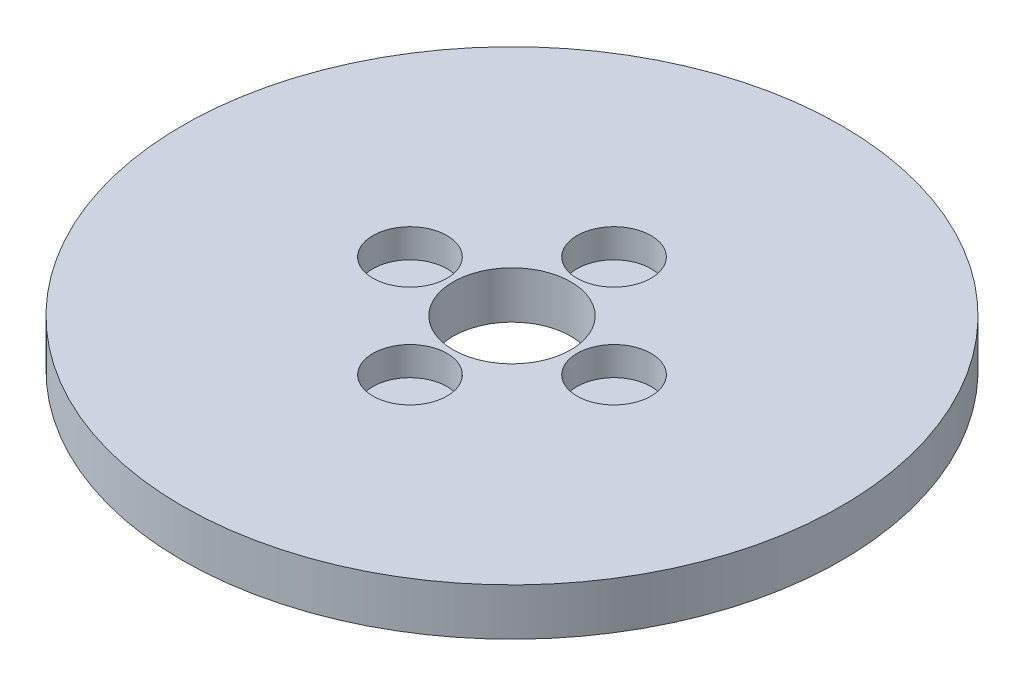
ISO-10303-21;
HEADER;
FILE_DESCRIPTION(('STEP AP214'),'2;1');
FILE_NAME('part.step','',(''),(''),'','','');
FILE_SCHEMA(('AUTOMOTIVE_DESIGN { 1 0 10303 214 1 1 1 1 }'));
ENDSEC;
DATA;
#1=APPLICATION_CONTEXT('core data for automotive mechanical design processes');
#2=APPLICATION_PROTOCOL_DEFINITION('international standard','automotive_design',2000,#1);
#3=PRODUCT_CONTEXT('',#1,'mechanical');
#4=PRODUCT('Part','Part','',(#3));
#5=PRODUCT_RELATED_PRODUCT_CATEGORY('part','',(#4));
#6=PRODUCT_DEFINITION_FORMATION('','',#4);
#7=PRODUCT_DEFINITION_CONTEXT('part definition',#1,'design');
#8=PRODUCT_DEFINITION('design','',#6,#7);
#9=PRODUCT_DEFINITION_SHAPE('','',#8);
#10=(LENGTH_UNIT() NAMED_UNIT(*) SI_UNIT(.MILLI.,.METRE.));
#11=(NAMED_UNIT(*) PLANE_ANGLE_UNIT() SI_UNIT($,.RADIAN.));
#12=(NAMED_UNIT(*) SI_UNIT($,.STERADIAN.) SOLID_ANGLE_UNIT());
#13=UNCERTAINTY_MEASURE_WITH_UNIT(LENGTH_MEASURE(1.E-05),#10,'distance_accuracy_value','');
#14=(GEOMETRIC_REPRESENTATION_CONTEXT(3) GLOBAL_UNCERTAINTY_ASSIGNED_CONTEXT((#13)) GLOBAL_UNIT_ASSIGNED_CONTEXT((#10,
#11,#12)) REPRESENTATION_CONTEXT('',''));
#15=CARTESIAN_POINT('',(0.,0.,0.));
#16=DIRECTION('',(0.,0.,1.));
#17=DIRECTION('',(1.,0.,0.));
#18=AXIS2_PLACEMENT_3D('',#15,#16,#17);
#19=CARTESIAN_POINT('',(0.,10.,0.));
#20=DIRECTION('',(0.,-1.,0.));
#21=DIRECTION('',(0.,0.,-1.));
#22=AXIS2_PLACEMENT_3D('',#19,#20,#21);
#23=CYLINDRICAL_SURFACE('',#22,70.);
#24=CARTESIAN_POINT('',(0.,10.,0.));
#25=DIRECTION('',(0.,1.,0.));
#26=DIRECTION('',(0.,0.,1.));
#27=AXIS2_PLACEMENT_3D('',#24,#25,#26);
#28=CIRCLE('',#27,70.);
#29=CARTESIAN_POINT('',(0.,10.,70.));
#30=VERTEX_POINT('',#29);
#31=EDGE_CURVE('E10',#30,#30,#28,.T.);
#32=ORIENTED_EDGE('',*,*,#31,.F.);
#33=EDGE_LOOP('',(#32));
#34=FACE_BOUND('',#33,.T.);
#35=CARTESIAN_POINT('',(0.,0.,0.));
#36=DIRECTION('',(0.,1.,0.));
#37=DIRECTION('',(0.,0.,1.));
#38=AXIS2_PLACEMENT_3D('',#35,#36,#37);
#39=CIRCLE('',#38,70.);
#40=CARTESIAN_POINT('',(0.,0.,70.));
#41=VERTEX_POINT('',#40);
#42=EDGE_CURVE('E37',#41,#41,#39,.T.);
#43=ORIENTED_EDGE('',*,*,#42,.T.);
#44=EDGE_LOOP('',(#43));
#45=FACE_BOUND('',#44,.T.);
#46=ADVANCED_FACE('F40',(#34,#45),#23,.T.);
#47=CARTESIAN_POINT('',(0.,10.,0.));
#48=DIRECTION('',(0.,1.,0.));
#49=DIRECTION('',(0.,0.,1.));
#50=AXIS2_PLACEMENT_3D('',#47,#48,#49);
#51=PLANE('',#50);
#52=CARTESIAN_POINT('',(0.,10.,21.6730612418728));
#53=DIRECTION('',(0.,1.,0.));
#54=DIRECTION('',(1.,0.,0.));
#55=AXIS2_PLACEMENT_3D('',#52,#53,#54);
#56=CIRCLE('',#55,7.86600903500661);
#57=CARTESIAN_POINT('',(7.86600903500669,10.,21.6730612418727));
#58=VERTEX_POINT('',#57);
#59=EDGE_CURVE('E71',#58,#58,#56,.T.);
#60=ORIENTED_EDGE('',*,*,#59,.F.);
#61=EDGE_LOOP('',(#60));
#62=FACE_BOUND('',#61,.T.);
#63=CARTESIAN_POINT('',(21.6730612418728,10.,0.));
#64=DIRECTION('',(0.,1.,0.));
#65=DIRECTION('',(0.,0.,-1.));
#66=AXIS2_PLACEMENT_3D('',#63,#64,#65);
#67=CIRCLE('',#66,7.86600903500661);
#68=CARTESIAN_POINT('',(21.6730612418728,10.,-7.86600903500661));
#69=VERTEX_POINT('',#68);
#70=EDGE_CURVE('E70',#69,#69,#67,.T.);
#71=ORIENTED_EDGE('',*,*,#70,.F.);
#72=EDGE_LOOP('',(#71));
#73=FACE_BOUND('',#72,.T.);
#74=CARTESIAN_POINT('',(-2.27013266644809E-13,10.,-21.6730612418728));
#75=DIRECTION('',(0.,1.,0.));
#76=DIRECTION('',(-1.,0.,0.));
#77=AXIS2_PLACEMENT_3D('',#74,#75,#76);
#78=CIRCLE('',#77,7.86600903500661);
#79=CARTESIAN_POINT('',(-7.86600903500684,10.,-21.6730612418727));
#80=VERTEX_POINT('',#79);
#81=EDGE_CURVE('E61',#80,#80,#78,.T.);
#82=ORIENTED_EDGE('',*,*,#81,.F.);
#83=EDGE_LOOP('',(#82));
#84=FACE_BOUND('',#83,.T.);
#85=CARTESIAN_POINT('',(-21.6730612418728,10.,0.));
#86=DIRECTION('',(0.,1.,0.));
#87=DIRECTION('',(0.,0.,1.));
#88=AXIS2_PLACEMENT_3D('',#85,#86,#87);
#89=CIRCLE('',#88,7.86600903500661);
#90=CARTESIAN_POINT('',(-21.6730612418728,10.,7.86600903500661));
#91=VERTEX_POINT('',#90);
#92=EDGE_CURVE('E54',#91,#91,#89,.T.);
#93=ORIENTED_EDGE('',*,*,#92,.F.);
#94=EDGE_LOOP('',(#93));
#95=FACE_BOUND('',#94,.T.);
#96=CARTESIAN_POINT('',(0.,10.,0.));
#97=DIRECTION('',(0.,1.,0.));
#98=DIRECTION('',(0.,0.,1.));
#99=AXIS2_PLACEMENT_3D('',#96,#97,#98);
#100=CIRCLE('',#99,12.5);
#101=CARTESIAN_POINT('',(0.,10.,12.5));
#102=VERTEX_POINT('',#101);
#103=EDGE_CURVE('E50',#102,#102,#100,.T.);
#104=ORIENTED_EDGE('',*,*,#103,.F.);
#105=EDGE_LOOP('',(#104));
#106=FACE_BOUND('',#105,.T.);
#107=ORIENTED_EDGE('',*,*,#31,.T.);
#108=EDGE_LOOP('',(#107));
#109=FACE_BOUND('',#108,.T.);
#110=ADVANCED_FACE('F86',(#62,#73,#84,#95,#106,#109),#51,.T.);
#111=CARTESIAN_POINT('',(0.,0.,0.));
#112=DIRECTION('',(0.,1.,0.));
#113=DIRECTION('',(0.,0.,1.));
#114=AXIS2_PLACEMENT_3D('',#111,#112,#113);
#115=PLANE('',#114);
#116=CARTESIAN_POINT('',(0.,0.,0.));
#117=DIRECTION('',(0.,1.,0.));
#118=DIRECTION('',(0.,0.,1.));
#119=AXIS2_PLACEMENT_3D('',#116,#117,#118);
#120=CIRCLE('',#119,12.5);
#121=CARTESIAN_POINT('',(0.,0.,12.5));
#122=VERTEX_POINT('',#121);
#123=EDGE_CURVE('E47',#122,#122,#120,.T.);
#124=ORIENTED_EDGE('',*,*,#123,.T.);
#125=EDGE_LOOP('',(#124));
#126=FACE_BOUND('',#125,.T.);
#127=ORIENTED_EDGE('',*,*,#42,.F.);
#128=EDGE_LOOP('',(#127));
#129=FACE_BOUND('',#128,.T.);
#130=ADVANCED_FACE('F93',(#126,#129),#115,.F.);
#131=CARTESIAN_POINT('',(0.,10.,0.));
#132=DIRECTION('',(0.,-1.,0.));
#133=DIRECTION('',(0.,0.,-1.));
#134=AXIS2_PLACEMENT_3D('',#131,#132,#133);
#135=CYLINDRICAL_SURFACE('',#134,12.5);
#136=ORIENTED_EDGE('',*,*,#103,.T.);
#137=EDGE_LOOP('',(#136));
#138=FACE_BOUND('',#137,.T.);
#139=ORIENTED_EDGE('',*,*,#123,.F.);
#140=EDGE_LOOP('',(#139));
#141=FACE_BOUND('',#140,.T.);
#142=ADVANCED_FACE('F101',(#138,#141),#135,.F.);
#143=CARTESIAN_POINT('',(-21.6730612418728,3.89825433813243,0.));
#144=DIRECTION('',(0.,1.,0.));
#145=DIRECTION('',(0.,0.,1.));
#146=AXIS2_PLACEMENT_3D('',#143,#144,#145);
#147=CYLINDRICAL_SURFACE('',#146,7.86600903500661);
#148=CARTESIAN_POINT('',(-21.6730612418728,3.89825433813243,0.));
#149=DIRECTION('',(0.,1.,0.));
#150=DIRECTION('',(0.,0.,1.));
#151=AXIS2_PLACEMENT_3D('',#148,#149,#150);
#152=CIRCLE('',#151,7.86600903500661);
#153=CARTESIAN_POINT('',(-21.6730612418728,3.89825433813243,7.86600903500661));
#154=VERTEX_POINT('',#153);
#155=EDGE_CURVE('E55',#154,#154,#152,.T.);
#156=ORIENTED_EDGE('',*,*,#155,.F.);
#157=EDGE_LOOP('',(#156));
#158=FACE_BOUND('',#157,.T.);
#159=ORIENTED_EDGE('',*,*,#92,.T.);
#160=EDGE_LOOP('',(#159));
#161=FACE_BOUND('',#160,.T.);
#162=ADVANCED_FACE('F102',(#158,#161),#147,.F.);
#163=CARTESIAN_POINT('',(-21.6730612418728,3.89825433813243,0.));
#164=DIRECTION('',(0.,1.,0.));
#165=DIRECTION('',(0.,0.,1.));
#166=AXIS2_PLACEMENT_3D('',#163,#164,#165);
#167=PLANE('',#166);
#168=ORIENTED_EDGE('',*,*,#155,.T.);
#169=EDGE_LOOP('',(#168));
#170=FACE_BOUND('',#169,.T.);
#171=ADVANCED_FACE('F133',(#170),#167,.T.);
#172=CARTESIAN_POINT('',(-2.27013266644809E-13,3.89825433813243,-21.6730612418728));
#173=DIRECTION('',(0.,1.,0.));
#174=DIRECTION('',(0.,0.,1.));
#175=AXIS2_PLACEMENT_3D('',#172,#173,#174);
#176=CYLINDRICAL_SURFACE('',#175,7.86600903500661);
#177=CARTESIAN_POINT('',(-2.27013266644809E-13,3.89825433813243,-21.6730612418728));
#178=DIRECTION('',(0.,1.,0.));
#179=DIRECTION('',(-1.,0.,0.));
#180=AXIS2_PLACEMENT_3D('',#177,#178,#179);
#181=CIRCLE('',#180,7.86600903500661);
#182=CARTESIAN_POINT('',(-7.86600903500684,3.89825433813243,-21.6730612418727));
#183=VERTEX_POINT('',#182);
#184=EDGE_CURVE('E63',#183,#183,#181,.T.);
#185=ORIENTED_EDGE('',*,*,#184,.F.);
#186=EDGE_LOOP('',(#185));
#187=FACE_BOUND('',#186,.T.);
#188=ORIENTED_EDGE('',*,*,#81,.T.);
#189=EDGE_LOOP('',(#188));
#190=FACE_BOUND('',#189,.T.);
#191=ADVANCED_FACE('F142',(#187,#190),#176,.F.);
#192=CARTESIAN_POINT('',(-2.27013266644809E-13,3.89825433813243,-21.6730612418728));
#193=DIRECTION('',(0.,1.,0.));
#194=DIRECTION('',(-1.,0.,0.));
#195=AXIS2_PLACEMENT_3D('',#192,#193,#194);
#196=PLANE('',#195);
#197=ORIENTED_EDGE('',*,*,#184,.T.);
#198=EDGE_LOOP('',(#197));
#199=FACE_BOUND('',#198,.T.);
#200=ADVANCED_FACE('F156',(#199),#196,.T.);
#201=CARTESIAN_POINT('',(21.6730612418728,3.89825433813243,0.));
#202=DIRECTION('',(0.,1.,0.));
#203=DIRECTION('',(0.,0.,1.));
#204=AXIS2_PLACEMENT_3D('',#201,#202,#203);
#205=CYLINDRICAL_SURFACE('',#204,7.86600903500661);
#206=CARTESIAN_POINT('',(21.6730612418728,3.89825433813243,0.));
#207=DIRECTION('',(0.,1.,0.));
#208=DIRECTION('',(0.,0.,-1.));
#209=AXIS2_PLACEMENT_3D('',#206,#207,#208);
#210=CIRCLE('',#209,7.86600903500661);
#211=CARTESIAN_POINT('',(21.6730612418728,3.89825433813243,-7.86600903500661));
#212=VERTEX_POINT('',#211);
#213=EDGE_CURVE('E69',#212,#212,#210,.T.);
#214=ORIENTED_EDGE('',*,*,#213,.F.);
#215=EDGE_LOOP('',(#214));
#216=FACE_BOUND('',#215,.T.);
#217=ORIENTED_EDGE('',*,*,#70,.T.);
#218=EDGE_LOOP('',(#217));
#219=FACE_BOUND('',#218,.T.);
#220=ADVANCED_FACE('F164',(#216,#219),#205,.F.);
#221=CARTESIAN_POINT('',(21.6730612418728,3.89825433813243,0.));
#222=DIRECTION('',(0.,1.,0.));
#223=DIRECTION('',(0.,0.,-1.));
#224=AXIS2_PLACEMENT_3D('',#221,#222,#223);
#225=PLANE('',#224);
#226=ORIENTED_EDGE('',*,*,#213,.T.);
#227=EDGE_LOOP('',(#226));
#228=FACE_BOUND('',#227,.T.);
#229=ADVANCED_FACE('F83',(#228),#225,.T.);
#230=CARTESIAN_POINT('',(0.,3.89825433813243,21.6730612418728));
#231=DIRECTION('',(0.,1.,0.));
#232=DIRECTION('',(0.,0.,1.));
#233=AXIS2_PLACEMENT_3D('',#230,#231,#232);
#234=CYLINDRICAL_SURFACE('',#233,7.86600903500661);
#235=CARTESIAN_POINT('',(0.,3.89825433813243,21.6730612418728));
#236=DIRECTION('',(0.,1.,0.));
#237=DIRECTION('',(1.,0.,0.));
#238=AXIS2_PLACEMENT_3D('',#235,#236,#237);
#239=CIRCLE('',#238,7.86600903500661);
#240=CARTESIAN_POINT('',(7.86600903500669,3.89825433813243,21.6730612418727));
#241=VERTEX_POINT('',#240);
#242=EDGE_CURVE('E59',#241,#241,#239,.T.);
#243=ORIENTED_EDGE('',*,*,#242,.F.);
#244=EDGE_LOOP('',(#243));
#245=FACE_BOUND('',#244,.T.);
#246=ORIENTED_EDGE('',*,*,#59,.T.);
#247=EDGE_LOOP('',(#246));
#248=FACE_BOUND('',#247,.T.);
#249=ADVANCED_FACE('F81',(#245,#248),#234,.F.);
#250=CARTESIAN_POINT('',(0.,3.89825433813243,21.6730612418728));
#251=DIRECTION('',(0.,1.,0.));
#252=DIRECTION('',(1.,0.,0.));
#253=AXIS2_PLACEMENT_3D('',#250,#251,#252);
#254=PLANE('',#253);
#255=ORIENTED_EDGE('',*,*,#242,.T.);
#256=EDGE_LOOP('',(#255));
#257=FACE_BOUND('',#256,.T.);
#258=ADVANCED_FACE('F78',(#257),#254,.T.);
#259=CLOSED_SHELL('',(#46,#110,#130,#142,#162,#171,#191,#200,#220,#229,#249,#258));
#260=MANIFOLD_SOLID_BREP('B2',#259);
#261=ADVANCED_BREP_SHAPE_REPRESENTATION('',(#18,#260),#14);
#262=SHAPE_DEFINITION_REPRESENTATION(#9,#261);
ENDSEC;
END-ISO-10303-21;
